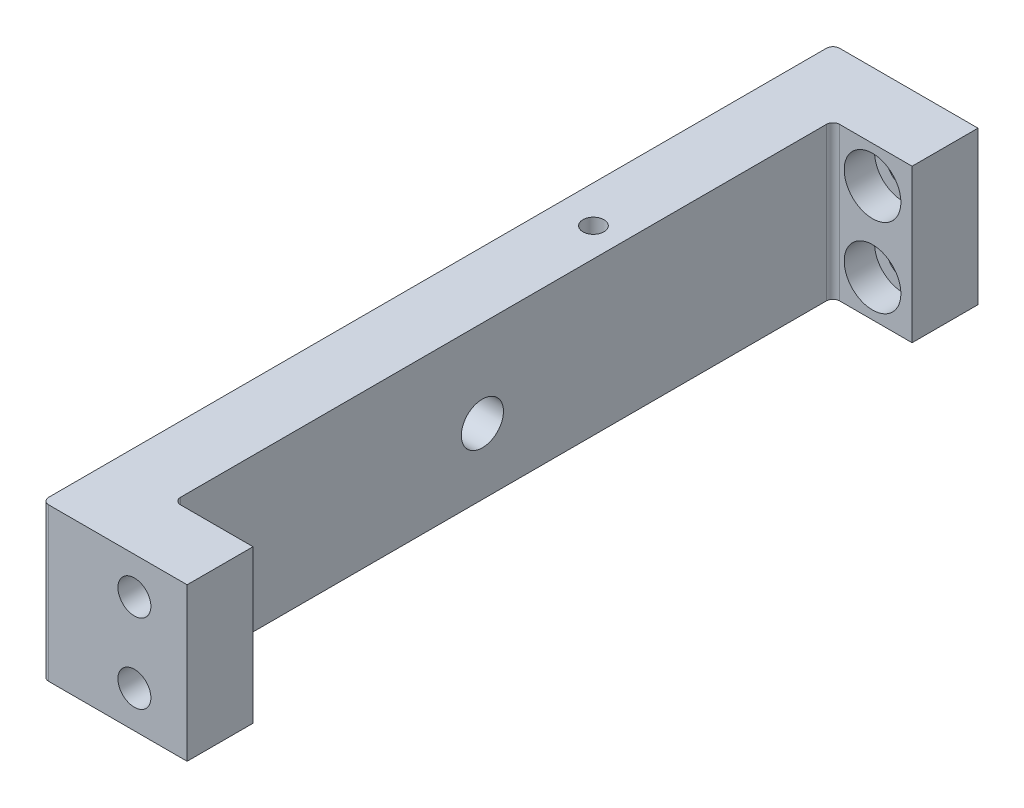
ISO-10303-21;
HEADER;
FILE_DESCRIPTION(('STEP AP214'),'2;1');
FILE_NAME('part.step','',(''),(''),'','','');
FILE_SCHEMA(('AUTOMOTIVE_DESIGN { 1 0 10303 214 1 1 1 1 }'));
ENDSEC;
DATA;
#1=APPLICATION_CONTEXT('core data for automotive mechanical design processes');
#2=APPLICATION_PROTOCOL_DEFINITION('international standard','automotive_design',2000,#1);
#3=PRODUCT_CONTEXT('',#1,'mechanical');
#4=PRODUCT('Part','Part','',(#3));
#5=PRODUCT_RELATED_PRODUCT_CATEGORY('part','',(#4));
#6=PRODUCT_DEFINITION_FORMATION('','',#4);
#7=PRODUCT_DEFINITION_CONTEXT('part definition',#1,'design');
#8=PRODUCT_DEFINITION('design','',#6,#7);
#9=PRODUCT_DEFINITION_SHAPE('','',#8);
#10=(LENGTH_UNIT() NAMED_UNIT(*) SI_UNIT(.MILLI.,.METRE.));
#11=(NAMED_UNIT(*) PLANE_ANGLE_UNIT() SI_UNIT($,.RADIAN.));
#12=(NAMED_UNIT(*) SI_UNIT($,.STERADIAN.) SOLID_ANGLE_UNIT());
#13=UNCERTAINTY_MEASURE_WITH_UNIT(LENGTH_MEASURE(1.E-05),#10,'distance_accuracy_value','');
#14=(GEOMETRIC_REPRESENTATION_CONTEXT(3) GLOBAL_UNCERTAINTY_ASSIGNED_CONTEXT((#13)) GLOBAL_UNIT_ASSIGNED_CONTEXT((#10,
#11,#12)) REPRESENTATION_CONTEXT('',''));
#15=CARTESIAN_POINT('',(0.,0.,0.));
#16=DIRECTION('',(0.,0.,1.));
#17=DIRECTION('',(1.,0.,0.));
#18=AXIS2_PLACEMENT_3D('',#15,#16,#17);
#19=CARTESIAN_POINT('',(2.5,-5.8,30.));
#20=DIRECTION('',(-1.,0.,0.));
#21=DIRECTION('',(0.,0.,1.));
#22=AXIS2_PLACEMENT_3D('',#19,#20,#21);
#23=PLANE('',#22);
#24=CARTESIAN_POINT('',(2.5,-0.799999999999957,1.59999999999999));
#25=DIRECTION('',(-1.,0.,0.));
#26=DIRECTION('',(0.,0.,1.));
#27=AXIS2_PLACEMENT_3D('',#24,#25,#26);
#28=CIRCLE('',#27,1.6);
#29=CARTESIAN_POINT('',(2.5,-0.799999999999957,3.19999999999999));
#30=VERTEX_POINT('',#29);
#31=EDGE_CURVE('E145',#30,#30,#28,.T.);
#32=ORIENTED_EDGE('',*,*,#31,.T.);
#33=EDGE_LOOP('',(#32));
#34=FACE_BOUND('',#33,.T.);
#35=DIRECTION('',(0.,0.,-1.));
#36=VECTOR('',#35,1.);
#37=CARTESIAN_POINT('',(2.5,-5.8,30.));
#38=LINE('',#37,#36);
#39=CARTESIAN_POINT('',(2.5,-5.8,24.5));
#40=VERTEX_POINT('',#39);
#41=CARTESIAN_POINT('',(2.5,-5.8,-24.5));
#42=VERTEX_POINT('',#41);
#43=EDGE_CURVE('E233',#40,#42,#38,.T.);
#44=ORIENTED_EDGE('',*,*,#43,.T.);
#45=DIRECTION('',(0.,1.,0.));
#46=VECTOR('',#45,1.);
#47=CARTESIAN_POINT('',(2.5,-5.80000000000002,-24.5));
#48=LINE('',#47,#46);
#49=CARTESIAN_POINT('',(2.5,5.8,-24.5));
#50=VERTEX_POINT('',#49);
#51=EDGE_CURVE('E260',#42,#50,#48,.T.);
#52=ORIENTED_EDGE('',*,*,#51,.T.);
#53=DIRECTION('',(0.,0.,-1.));
#54=VECTOR('',#53,1.);
#55=CARTESIAN_POINT('',(2.5,5.8,30.));
#56=LINE('',#55,#54);
#57=CARTESIAN_POINT('',(2.5,5.8,24.5));
#58=VERTEX_POINT('',#57);
#59=EDGE_CURVE('E231',#58,#50,#56,.T.);
#60=ORIENTED_EDGE('',*,*,#59,.F.);
#61=DIRECTION('',(0.,1.,0.));
#62=VECTOR('',#61,1.);
#63=CARTESIAN_POINT('',(2.5,-5.8,24.5));
#64=LINE('',#63,#62);
#65=EDGE_CURVE('E258',#58,#40,#64,.F.);
#66=ORIENTED_EDGE('',*,*,#65,.T.);
#67=EDGE_LOOP('',(#44,#52,#60,#66));
#68=FACE_BOUND('',#67,.T.);
#69=ADVANCED_FACE('F42',(#34,#68),#23,.F.);
#70=CARTESIAN_POINT('',(-2.5,-5.8,30.));
#71=DIRECTION('',(1.,0.,0.));
#72=DIRECTION('',(0.,0.,-1.));
#73=AXIS2_PLACEMENT_3D('',#70,#71,#72);
#74=PLANE('',#73);
#75=CARTESIAN_POINT('',(-2.5,-0.799999999999957,1.59999999999999));
#76=DIRECTION('',(-1.,0.,0.));
#77=DIRECTION('',(0.,0.,1.));
#78=AXIS2_PLACEMENT_3D('',#75,#76,#77);
#79=CIRCLE('',#78,1.6);
#80=CARTESIAN_POINT('',(-2.5,-0.799999999999957,3.19999999999999));
#81=VERTEX_POINT('',#80);
#82=EDGE_CURVE('E141',#81,#81,#79,.T.);
#83=ORIENTED_EDGE('',*,*,#82,.F.);
#84=EDGE_LOOP('',(#83));
#85=FACE_BOUND('',#84,.T.);
#86=DIRECTION('',(0.,0.,-1.));
#87=VECTOR('',#86,1.);
#88=CARTESIAN_POINT('',(-2.5,5.8,30.));
#89=LINE('',#88,#87);
#90=CARTESIAN_POINT('',(-2.5,5.8,29.5));
#91=VERTEX_POINT('',#90);
#92=CARTESIAN_POINT('',(-2.5,5.8,-29.5));
#93=VERTEX_POINT('',#92);
#94=EDGE_CURVE('E225',#91,#93,#89,.T.);
#95=ORIENTED_EDGE('',*,*,#94,.T.);
#96=DIRECTION('',(0.,-1.,0.));
#97=VECTOR('',#96,1.);
#98=CARTESIAN_POINT('',(-2.5,-5.8,-29.5));
#99=LINE('',#98,#97);
#100=CARTESIAN_POINT('',(-2.5,-5.8,-29.5));
#101=VERTEX_POINT('',#100);
#102=EDGE_CURVE('E245',#93,#101,#99,.T.);
#103=ORIENTED_EDGE('',*,*,#102,.T.);
#104=DIRECTION('',(0.,0.,-1.));
#105=VECTOR('',#104,1.);
#106=CARTESIAN_POINT('',(-2.5,-5.8,30.));
#107=LINE('',#106,#105);
#108=CARTESIAN_POINT('',(-2.5,-5.8,29.5));
#109=VERTEX_POINT('',#108);
#110=EDGE_CURVE('E236',#109,#101,#107,.T.);
#111=ORIENTED_EDGE('',*,*,#110,.F.);
#112=DIRECTION('',(0.,-1.,0.));
#113=VECTOR('',#112,1.);
#114=CARTESIAN_POINT('',(-2.5,5.8,29.5));
#115=LINE('',#114,#113);
#116=EDGE_CURVE('E239',#109,#91,#115,.F.);
#117=ORIENTED_EDGE('',*,*,#116,.T.);
#118=EDGE_LOOP('',(#95,#103,#111,#117));
#119=FACE_BOUND('',#118,.T.);
#120=ADVANCED_FACE('F302',(#85,#119),#74,.F.);
#121=CARTESIAN_POINT('',(2.5,-5.8,30.));
#122=DIRECTION('',(0.,1.,0.));
#123=DIRECTION('',(0.,0.,1.));
#124=AXIS2_PLACEMENT_3D('',#121,#122,#123);
#125=PLANE('',#124);
#126=ORIENTED_EDGE('',*,*,#110,.T.);
#127=CARTESIAN_POINT('',(-2.,-5.8,-29.5));
#128=DIRECTION('',(0.,1.,0.));
#129=DIRECTION('',(0.,0.,1.));
#130=AXIS2_PLACEMENT_3D('',#127,#128,#129);
#131=CIRCLE('',#130,0.5);
#132=CARTESIAN_POINT('',(-2.,-5.8,-30.));
#133=VERTEX_POINT('',#132);
#134=EDGE_CURVE('E250',#101,#133,#131,.F.);
#135=ORIENTED_EDGE('',*,*,#134,.T.);
#136=DIRECTION('',(1.,0.,0.));
#137=VECTOR('',#136,1.);
#138=CARTESIAN_POINT('',(2.5,-5.8,-30.));
#139=LINE('',#138,#137);
#140=CARTESIAN_POINT('',(8.5,-5.8,-30.));
#141=VERTEX_POINT('',#140);
#142=EDGE_CURVE('E218',#133,#141,#139,.T.);
#143=ORIENTED_EDGE('',*,*,#142,.T.);
#144=DIRECTION('',(0.,0.,1.));
#145=VECTOR('',#144,1.);
#146=CARTESIAN_POINT('',(8.5,-5.8,-25.));
#147=LINE('',#146,#145);
#148=CARTESIAN_POINT('',(8.5,-5.8,-25.));
#149=VERTEX_POINT('',#148);
#150=EDGE_CURVE('E184',#141,#149,#147,.T.);
#151=ORIENTED_EDGE('',*,*,#150,.T.);
#152=DIRECTION('',(-1.,0.,0.));
#153=VECTOR('',#152,1.);
#154=CARTESIAN_POINT('',(8.5,-5.8,-25.));
#155=LINE('',#154,#153);
#156=CARTESIAN_POINT('',(3.,-5.8,-25.));
#157=VERTEX_POINT('',#156);
#158=EDGE_CURVE('E196',#149,#157,#155,.T.);
#159=ORIENTED_EDGE('',*,*,#158,.T.);
#160=CARTESIAN_POINT('',(3.,-5.8,-24.5));
#161=DIRECTION('',(0.,1.,0.));
#162=DIRECTION('',(0.,0.,1.));
#163=AXIS2_PLACEMENT_3D('',#160,#161,#162);
#164=CIRCLE('',#163,0.5);
#165=EDGE_CURVE('E271',#157,#42,#164,.T.);
#166=ORIENTED_EDGE('',*,*,#165,.T.);
#167=ORIENTED_EDGE('',*,*,#43,.F.);
#168=CARTESIAN_POINT('',(3.,-5.8,24.5));
#169=DIRECTION('',(0.,1.,0.));
#170=DIRECTION('',(0.,0.,1.));
#171=AXIS2_PLACEMENT_3D('',#168,#169,#170);
#172=CIRCLE('',#171,0.5);
#173=CARTESIAN_POINT('',(3.,-5.8,25.));
#174=VERTEX_POINT('',#173);
#175=EDGE_CURVE('E11',#40,#174,#172,.T.);
#176=ORIENTED_EDGE('',*,*,#175,.T.);
#177=DIRECTION('',(-1.,0.,0.));
#178=VECTOR('',#177,1.);
#179=CARTESIAN_POINT('',(8.5,-5.8,25.));
#180=LINE('',#179,#178);
#181=CARTESIAN_POINT('',(8.5,-5.8,25.));
#182=VERTEX_POINT('',#181);
#183=EDGE_CURVE('E215',#182,#174,#180,.T.);
#184=ORIENTED_EDGE('',*,*,#183,.F.);
#185=DIRECTION('',(0.,0.,-1.));
#186=VECTOR('',#185,1.);
#187=CARTESIAN_POINT('',(8.5,-5.8,25.));
#188=LINE('',#187,#186);
#189=CARTESIAN_POINT('',(8.5,-5.8,30.));
#190=VERTEX_POINT('',#189);
#191=EDGE_CURVE('E201',#190,#182,#188,.T.);
#192=ORIENTED_EDGE('',*,*,#191,.F.);
#193=DIRECTION('',(1.,0.,0.));
#194=VECTOR('',#193,1.);
#195=CARTESIAN_POINT('',(2.5,-5.8,30.));
#196=LINE('',#195,#194);
#197=CARTESIAN_POINT('',(-2.,-5.8,30.));
#198=VERTEX_POINT('',#197);
#199=EDGE_CURVE('E219',#198,#190,#196,.T.);
#200=ORIENTED_EDGE('',*,*,#199,.F.);
#201=CARTESIAN_POINT('',(-2.,-5.8,29.5));
#202=DIRECTION('',(0.,1.,0.));
#203=DIRECTION('',(0.,0.,1.));
#204=AXIS2_PLACEMENT_3D('',#201,#202,#203);
#205=CIRCLE('',#204,0.5);
#206=EDGE_CURVE('E248',#198,#109,#205,.F.);
#207=ORIENTED_EDGE('',*,*,#206,.T.);
#208=EDGE_LOOP('',(#126,#135,#143,#151,#159,#166,#167,#176,#184,#192,#200,#207));
#209=FACE_BOUND('',#208,.T.);
#210=ADVANCED_FACE('F285',(#209),#125,.F.);
#211=CARTESIAN_POINT('',(2.5,5.8,30.));
#212=DIRECTION('',(0.,-1.,0.));
#213=DIRECTION('',(0.,0.,-1.));
#214=AXIS2_PLACEMENT_3D('',#211,#212,#213);
#215=PLANE('',#214);
#216=CARTESIAN_POINT('',(0.324999999999982,5.8,-8.99999999999998));
#217=DIRECTION('',(0.,1.,0.));
#218=DIRECTION('',(0.,0.,1.));
#219=AXIS2_PLACEMENT_3D('',#216,#217,#218);
#220=CIRCLE('',#219,0.79999999999999);
#221=CARTESIAN_POINT('',(0.324999999999982,5.8,-8.19999999999999));
#222=VERTEX_POINT('',#221);
#223=EDGE_CURVE('E142',#222,#222,#220,.T.);
#224=ORIENTED_EDGE('',*,*,#223,.F.);
#225=EDGE_LOOP('',(#224));
#226=FACE_BOUND('',#225,.T.);
#227=DIRECTION('',(-1.,0.,0.));
#228=VECTOR('',#227,1.);
#229=CARTESIAN_POINT('',(2.5,5.8,-30.));
#230=LINE('',#229,#228);
#231=CARTESIAN_POINT('',(8.5,5.8,-30.));
#232=VERTEX_POINT('',#231);
#233=CARTESIAN_POINT('',(-2.,5.8,-30.));
#234=VERTEX_POINT('',#233);
#235=EDGE_CURVE('E222',#232,#234,#230,.T.);
#236=ORIENTED_EDGE('',*,*,#235,.T.);
#237=CARTESIAN_POINT('',(-2.,5.8,-29.5));
#238=DIRECTION('',(0.,-1.,0.));
#239=DIRECTION('',(0.,0.,-1.));
#240=AXIS2_PLACEMENT_3D('',#237,#238,#239);
#241=CIRCLE('',#240,0.5);
#242=EDGE_CURVE('E256',#234,#93,#241,.F.);
#243=ORIENTED_EDGE('',*,*,#242,.T.);
#244=ORIENTED_EDGE('',*,*,#94,.F.);
#245=CARTESIAN_POINT('',(-2.,5.8,29.5));
#246=DIRECTION('',(0.,-1.,0.));
#247=DIRECTION('',(0.,0.,-1.));
#248=AXIS2_PLACEMENT_3D('',#245,#246,#247);
#249=CIRCLE('',#248,0.5);
#250=CARTESIAN_POINT('',(-2.,5.8,30.));
#251=VERTEX_POINT('',#250);
#252=EDGE_CURVE('E254',#91,#251,#249,.F.);
#253=ORIENTED_EDGE('',*,*,#252,.T.);
#254=DIRECTION('',(-1.,0.,0.));
#255=VECTOR('',#254,1.);
#256=CARTESIAN_POINT('',(2.5,5.8,30.));
#257=LINE('',#256,#255);
#258=CARTESIAN_POINT('',(8.5,5.8,30.));
#259=VERTEX_POINT('',#258);
#260=EDGE_CURVE('E221',#259,#251,#257,.T.);
#261=ORIENTED_EDGE('',*,*,#260,.F.);
#262=DIRECTION('',(0.,0.,1.));
#263=VECTOR('',#262,1.);
#264=CARTESIAN_POINT('',(8.5,5.8,30.));
#265=LINE('',#264,#263);
#266=CARTESIAN_POINT('',(8.5,5.8,25.));
#267=VERTEX_POINT('',#266);
#268=EDGE_CURVE('E206',#267,#259,#265,.T.);
#269=ORIENTED_EDGE('',*,*,#268,.F.);
#270=DIRECTION('',(-1.,0.,0.));
#271=VECTOR('',#270,1.);
#272=CARTESIAN_POINT('',(8.5,5.8,25.));
#273=LINE('',#272,#271);
#274=CARTESIAN_POINT('',(3.,5.8,25.));
#275=VERTEX_POINT('',#274);
#276=EDGE_CURVE('E212',#267,#275,#273,.T.);
#277=ORIENTED_EDGE('',*,*,#276,.T.);
#278=CARTESIAN_POINT('',(3.,5.8,24.5));
#279=DIRECTION('',(0.,-1.,0.));
#280=DIRECTION('',(0.,0.,-1.));
#281=AXIS2_PLACEMENT_3D('',#278,#279,#280);
#282=CIRCLE('',#281,0.5);
#283=EDGE_CURVE('E50',#275,#58,#282,.T.);
#284=ORIENTED_EDGE('',*,*,#283,.T.);
#285=ORIENTED_EDGE('',*,*,#59,.T.);
#286=CARTESIAN_POINT('',(3.,5.8,-24.5));
#287=DIRECTION('',(0.,-1.,0.));
#288=DIRECTION('',(0.,0.,-1.));
#289=AXIS2_PLACEMENT_3D('',#286,#287,#288);
#290=CIRCLE('',#289,0.5);
#291=CARTESIAN_POINT('',(3.,5.8,-25.));
#292=VERTEX_POINT('',#291);
#293=EDGE_CURVE('E57',#50,#292,#290,.T.);
#294=ORIENTED_EDGE('',*,*,#293,.T.);
#295=DIRECTION('',(-1.,0.,0.));
#296=VECTOR('',#295,1.);
#297=CARTESIAN_POINT('',(8.5,5.8,-25.));
#298=LINE('',#297,#296);
#299=CARTESIAN_POINT('',(8.5,5.8,-25.));
#300=VERTEX_POINT('',#299);
#301=EDGE_CURVE('E199',#300,#292,#298,.T.);
#302=ORIENTED_EDGE('',*,*,#301,.F.);
#303=DIRECTION('',(0.,0.,-1.));
#304=VECTOR('',#303,1.);
#305=CARTESIAN_POINT('',(8.5,5.8,-30.));
#306=LINE('',#305,#304);
#307=EDGE_CURVE('E190',#300,#232,#306,.T.);
#308=ORIENTED_EDGE('',*,*,#307,.T.);
#309=EDGE_LOOP('',(#236,#243,#244,#253,#261,#269,#277,#284,#285,#294,#302,#308));
#310=FACE_BOUND('',#309,.T.);
#311=ADVANCED_FACE('F273',(#226,#310),#215,.F.);
#312=CARTESIAN_POINT('',(0.,0.,30.));
#313=DIRECTION('',(0.,0.,1.));
#314=DIRECTION('',(1.,0.,0.));
#315=AXIS2_PLACEMENT_3D('',#312,#313,#314);
#316=PLANE('',#315);
#317=CARTESIAN_POINT('',(4.5,-3.,30.));
#318=DIRECTION('',(0.,0.,1.));
#319=DIRECTION('',(1.,0.,0.));
#320=AXIS2_PLACEMENT_3D('',#317,#318,#319);
#321=CIRCLE('',#320,1.24999999999999);
#322=CARTESIAN_POINT('',(5.74999999999999,-3.,30.));
#323=VERTEX_POINT('',#322);
#324=EDGE_CURVE('E172',#323,#323,#321,.T.);
#325=ORIENTED_EDGE('',*,*,#324,.F.);
#326=EDGE_LOOP('',(#325));
#327=FACE_BOUND('',#326,.T.);
#328=CARTESIAN_POINT('',(4.5,3.,30.));
#329=DIRECTION('',(0.,0.,1.));
#330=DIRECTION('',(1.,0.,0.));
#331=AXIS2_PLACEMENT_3D('',#328,#329,#330);
#332=CIRCLE('',#331,1.24999999999999);
#333=CARTESIAN_POINT('',(5.74999999999999,3.,30.));
#334=VERTEX_POINT('',#333);
#335=EDGE_CURVE('E178',#334,#334,#332,.T.);
#336=ORIENTED_EDGE('',*,*,#335,.F.);
#337=EDGE_LOOP('',(#336));
#338=FACE_BOUND('',#337,.T.);
#339=ORIENTED_EDGE('',*,*,#260,.T.);
#340=DIRECTION('',(0.,-1.,0.));
#341=VECTOR('',#340,1.);
#342=CARTESIAN_POINT('',(-2.,-5.8,30.));
#343=LINE('',#342,#341);
#344=EDGE_CURVE('E267',#251,#198,#343,.T.);
#345=ORIENTED_EDGE('',*,*,#344,.T.);
#346=ORIENTED_EDGE('',*,*,#199,.T.);
#347=DIRECTION('',(0.,-1.,0.));
#348=VECTOR('',#347,1.);
#349=CARTESIAN_POINT('',(8.5,-5.8,30.));
#350=LINE('',#349,#348);
#351=EDGE_CURVE('E209',#259,#190,#350,.T.);
#352=ORIENTED_EDGE('',*,*,#351,.F.);
#353=EDGE_LOOP('',(#339,#345,#346,#352));
#354=FACE_BOUND('',#353,.T.);
#355=ADVANCED_FACE('F295',(#327,#338,#354),#316,.T.);
#356=CARTESIAN_POINT('',(0.,0.,-30.));
#357=DIRECTION('',(0.,0.,1.));
#358=DIRECTION('',(1.,0.,0.));
#359=AXIS2_PLACEMENT_3D('',#356,#357,#358);
#360=PLANE('',#359);
#361=CARTESIAN_POINT('',(5.5,-3.00000000000001,-30.));
#362=DIRECTION('',(0.,0.,1.));
#363=DIRECTION('',(1.,0.,0.));
#364=AXIS2_PLACEMENT_3D('',#361,#362,#363);
#365=CIRCLE('',#364,1.2);
#366=CARTESIAN_POINT('',(6.7,-3.00000000000001,-30.));
#367=VERTEX_POINT('',#366);
#368=EDGE_CURVE('E161',#367,#367,#365,.T.);
#369=ORIENTED_EDGE('',*,*,#368,.T.);
#370=EDGE_LOOP('',(#369));
#371=FACE_BOUND('',#370,.T.);
#372=CARTESIAN_POINT('',(5.5,2.99999999999999,-30.));
#373=DIRECTION('',(0.,0.,1.));
#374=DIRECTION('',(1.,0.,0.));
#375=AXIS2_PLACEMENT_3D('',#372,#373,#374);
#376=CIRCLE('',#375,1.2);
#377=CARTESIAN_POINT('',(6.7,2.99999999999999,-30.));
#378=VERTEX_POINT('',#377);
#379=EDGE_CURVE('E171',#378,#378,#376,.T.);
#380=ORIENTED_EDGE('',*,*,#379,.T.);
#381=EDGE_LOOP('',(#380));
#382=FACE_BOUND('',#381,.T.);
#383=ORIENTED_EDGE('',*,*,#142,.F.);
#384=DIRECTION('',(0.,-1.,0.));
#385=VECTOR('',#384,1.);
#386=CARTESIAN_POINT('',(-2.,0.,-30.));
#387=LINE('',#386,#385);
#388=EDGE_CURVE('E252',#133,#234,#387,.F.);
#389=ORIENTED_EDGE('',*,*,#388,.T.);
#390=ORIENTED_EDGE('',*,*,#235,.F.);
#391=DIRECTION('',(0.,-1.,0.));
#392=VECTOR('',#391,1.);
#393=CARTESIAN_POINT('',(8.5,-5.8,-30.));
#394=LINE('',#393,#392);
#395=EDGE_CURVE('E187',#232,#141,#394,.T.);
#396=ORIENTED_EDGE('',*,*,#395,.T.);
#397=EDGE_LOOP('',(#383,#389,#390,#396));
#398=FACE_BOUND('',#397,.T.);
#399=ADVANCED_FACE('F311',(#371,#382,#398),#360,.F.);
#400=CARTESIAN_POINT('',(8.5,5.8,25.));
#401=DIRECTION('',(0.,0.,1.));
#402=DIRECTION('',(0.,-1.,0.));
#403=AXIS2_PLACEMENT_3D('',#400,#401,#402);
#404=PLANE('',#403);
#405=CARTESIAN_POINT('',(4.5,-3.,25.));
#406=DIRECTION('',(0.,0.,1.));
#407=DIRECTION('',(0.,-1.,0.));
#408=AXIS2_PLACEMENT_3D('',#405,#406,#407);
#409=CIRCLE('',#408,1.24999999999999);
#410=CARTESIAN_POINT('',(4.5,-4.24999999999999,25.));
#411=VERTEX_POINT('',#410);
#412=EDGE_CURVE('E175',#411,#411,#409,.T.);
#413=ORIENTED_EDGE('',*,*,#412,.T.);
#414=EDGE_LOOP('',(#413));
#415=FACE_BOUND('',#414,.T.);
#416=CARTESIAN_POINT('',(4.5,3.,25.));
#417=DIRECTION('',(0.,0.,1.));
#418=DIRECTION('',(0.,-1.,0.));
#419=AXIS2_PLACEMENT_3D('',#416,#417,#418);
#420=CIRCLE('',#419,1.24999999999999);
#421=CARTESIAN_POINT('',(4.5,1.75000000000001,25.));
#422=VERTEX_POINT('',#421);
#423=EDGE_CURVE('E181',#422,#422,#420,.T.);
#424=ORIENTED_EDGE('',*,*,#423,.T.);
#425=EDGE_LOOP('',(#424));
#426=FACE_BOUND('',#425,.T.);
#427=ORIENTED_EDGE('',*,*,#183,.T.);
#428=DIRECTION('',(0.,1.,0.));
#429=VECTOR('',#428,1.);
#430=CARTESIAN_POINT('',(3.,5.8,25.));
#431=LINE('',#430,#429);
#432=EDGE_CURVE('E264',#174,#275,#431,.T.);
#433=ORIENTED_EDGE('',*,*,#432,.T.);
#434=ORIENTED_EDGE('',*,*,#276,.F.);
#435=DIRECTION('',(0.,1.,0.));
#436=VECTOR('',#435,1.);
#437=CARTESIAN_POINT('',(8.5,5.8,25.));
#438=LINE('',#437,#436);
#439=EDGE_CURVE('E204',#182,#267,#438,.T.);
#440=ORIENTED_EDGE('',*,*,#439,.F.);
#441=EDGE_LOOP('',(#427,#433,#434,#440));
#442=FACE_BOUND('',#441,.T.);
#443=ADVANCED_FACE('F288',(#415,#426,#442),#404,.F.);
#444=CARTESIAN_POINT('',(8.5,0.,0.));
#445=DIRECTION('',(-1.,0.,0.));
#446=DIRECTION('',(0.,0.,1.));
#447=AXIS2_PLACEMENT_3D('',#444,#445,#446);
#448=PLANE('',#447);
#449=ORIENTED_EDGE('',*,*,#191,.T.);
#450=ORIENTED_EDGE('',*,*,#439,.T.);
#451=ORIENTED_EDGE('',*,*,#268,.T.);
#452=ORIENTED_EDGE('',*,*,#351,.T.);
#453=EDGE_LOOP('',(#449,#450,#451,#452));
#454=FACE_BOUND('',#453,.T.);
#455=ADVANCED_FACE('F290',(#454),#448,.F.);
#456=CARTESIAN_POINT('',(8.5,5.8,-25.));
#457=DIRECTION('',(0.,0.,1.));
#458=DIRECTION('',(0.,-1.,0.));
#459=AXIS2_PLACEMENT_3D('',#456,#457,#458);
#460=PLANE('',#459);
#461=CARTESIAN_POINT('',(5.5,-3.00000000000001,-25.));
#462=DIRECTION('',(0.,0.,1.));
#463=DIRECTION('',(1.,0.,0.));
#464=AXIS2_PLACEMENT_3D('',#461,#462,#463);
#465=CIRCLE('',#464,2.15);
#466=CARTESIAN_POINT('',(7.65,-3.00000000000001,-25.));
#467=VERTEX_POINT('',#466);
#468=EDGE_CURVE('E152',#467,#467,#465,.T.);
#469=ORIENTED_EDGE('',*,*,#468,.F.);
#470=EDGE_LOOP('',(#469));
#471=FACE_BOUND('',#470,.T.);
#472=CARTESIAN_POINT('',(5.5,2.99999999999999,-25.));
#473=DIRECTION('',(0.,0.,1.));
#474=DIRECTION('',(1.,0.,0.));
#475=AXIS2_PLACEMENT_3D('',#472,#473,#474);
#476=CIRCLE('',#475,2.15);
#477=CARTESIAN_POINT('',(7.65,2.99999999999999,-25.));
#478=VERTEX_POINT('',#477);
#479=EDGE_CURVE('E162',#478,#478,#476,.T.);
#480=ORIENTED_EDGE('',*,*,#479,.F.);
#481=EDGE_LOOP('',(#480));
#482=FACE_BOUND('',#481,.T.);
#483=ORIENTED_EDGE('',*,*,#301,.T.);
#484=DIRECTION('',(0.,1.,0.));
#485=VECTOR('',#484,1.);
#486=CARTESIAN_POINT('',(3.,5.8,-25.));
#487=LINE('',#486,#485);
#488=EDGE_CURVE('E262',#292,#157,#487,.F.);
#489=ORIENTED_EDGE('',*,*,#488,.T.);
#490=ORIENTED_EDGE('',*,*,#158,.F.);
#491=DIRECTION('',(0.,1.,0.));
#492=VECTOR('',#491,1.);
#493=CARTESIAN_POINT('',(8.5,5.8,-25.));
#494=LINE('',#493,#492);
#495=EDGE_CURVE('E193',#149,#300,#494,.T.);
#496=ORIENTED_EDGE('',*,*,#495,.T.);
#497=EDGE_LOOP('',(#483,#489,#490,#496));
#498=FACE_BOUND('',#497,.T.);
#499=ADVANCED_FACE('F318',(#471,#482,#498),#460,.T.);
#500=CARTESIAN_POINT('',(8.5,0.,0.));
#501=DIRECTION('',(-1.,0.,0.));
#502=DIRECTION('',(0.,0.,-1.));
#503=AXIS2_PLACEMENT_3D('',#500,#501,#502);
#504=PLANE('',#503);
#505=ORIENTED_EDGE('',*,*,#150,.F.);
#506=ORIENTED_EDGE('',*,*,#395,.F.);
#507=ORIENTED_EDGE('',*,*,#307,.F.);
#508=ORIENTED_EDGE('',*,*,#495,.F.);
#509=EDGE_LOOP('',(#505,#506,#507,#508));
#510=FACE_BOUND('',#509,.T.);
#511=ADVANCED_FACE('F315',(#510),#504,.F.);
#512=CARTESIAN_POINT('',(4.5,3.,30.));
#513=DIRECTION('',(0.,0.,1.));
#514=DIRECTION('',(1.,0.,0.));
#515=AXIS2_PLACEMENT_3D('',#512,#513,#514);
#516=CYLINDRICAL_SURFACE('',#515,1.24999999999999);
#517=ORIENTED_EDGE('',*,*,#335,.T.);
#518=EDGE_LOOP('',(#517));
#519=FACE_BOUND('',#518,.T.);
#520=ORIENTED_EDGE('',*,*,#423,.F.);
#521=EDGE_LOOP('',(#520));
#522=FACE_BOUND('',#521,.T.);
#523=ADVANCED_FACE('F386',(#519,#522),#516,.F.);
#524=CARTESIAN_POINT('',(4.5,-3.,30.));
#525=DIRECTION('',(0.,0.,1.));
#526=DIRECTION('',(1.,0.,0.));
#527=AXIS2_PLACEMENT_3D('',#524,#525,#526);
#528=CYLINDRICAL_SURFACE('',#527,1.24999999999999);
#529=ORIENTED_EDGE('',*,*,#324,.T.);
#530=EDGE_LOOP('',(#529));
#531=FACE_BOUND('',#530,.T.);
#532=ORIENTED_EDGE('',*,*,#412,.F.);
#533=EDGE_LOOP('',(#532));
#534=FACE_BOUND('',#533,.T.);
#535=ADVANCED_FACE('F382',(#531,#534),#528,.F.);
#536=CARTESIAN_POINT('',(5.5,2.99999999999999,-25.));
#537=DIRECTION('',(0.,0.,1.));
#538=DIRECTION('',(1.,0.,0.));
#539=AXIS2_PLACEMENT_3D('',#536,#537,#538);
#540=CYLINDRICAL_SURFACE('',#539,1.2);
#541=CARTESIAN_POINT('',(5.5,2.99999999999999,-27.3));
#542=DIRECTION('',(0.,0.,1.));
#543=DIRECTION('',(1.,0.,0.));
#544=AXIS2_PLACEMENT_3D('',#541,#542,#543);
#545=CIRCLE('',#544,1.2);
#546=CARTESIAN_POINT('',(6.7,2.99999999999999,-27.3));
#547=VERTEX_POINT('',#546);
#548=EDGE_CURVE('E168',#547,#547,#545,.T.);
#549=ORIENTED_EDGE('',*,*,#548,.T.);
#550=EDGE_LOOP('',(#549));
#551=FACE_BOUND('',#550,.T.);
#552=ORIENTED_EDGE('',*,*,#379,.F.);
#553=EDGE_LOOP('',(#552));
#554=FACE_BOUND('',#553,.T.);
#555=ADVANCED_FACE('F378',(#551,#554),#540,.F.);
#556=CARTESIAN_POINT('',(6.7,2.99999999999999,-27.3));
#557=DIRECTION('',(0.,0.,-1.));
#558=DIRECTION('',(-1.,0.,0.));
#559=AXIS2_PLACEMENT_3D('',#556,#557,#558);
#560=PLANE('',#559);
#561=ORIENTED_EDGE('',*,*,#548,.F.);
#562=EDGE_LOOP('',(#561));
#563=FACE_BOUND('',#562,.T.);
#564=CARTESIAN_POINT('',(5.5,2.99999999999999,-27.3));
#565=DIRECTION('',(0.,0.,1.));
#566=DIRECTION('',(1.,0.,0.));
#567=AXIS2_PLACEMENT_3D('',#564,#565,#566);
#568=CIRCLE('',#567,2.15);
#569=CARTESIAN_POINT('',(7.65,2.99999999999999,-27.3));
#570=VERTEX_POINT('',#569);
#571=EDGE_CURVE('E165',#570,#570,#568,.T.);
#572=ORIENTED_EDGE('',*,*,#571,.T.);
#573=EDGE_LOOP('',(#572));
#574=FACE_BOUND('',#573,.T.);
#575=ADVANCED_FACE('F374',(#563,#574),#560,.F.);
#576=CARTESIAN_POINT('',(5.5,2.99999999999999,-25.));
#577=DIRECTION('',(0.,0.,1.));
#578=DIRECTION('',(1.,0.,0.));
#579=AXIS2_PLACEMENT_3D('',#576,#577,#578);
#580=CYLINDRICAL_SURFACE('',#579,2.15);
#581=ORIENTED_EDGE('',*,*,#571,.F.);
#582=EDGE_LOOP('',(#581));
#583=FACE_BOUND('',#582,.T.);
#584=ORIENTED_EDGE('',*,*,#479,.T.);
#585=EDGE_LOOP('',(#584));
#586=FACE_BOUND('',#585,.T.);
#587=ADVANCED_FACE('F370',(#583,#586),#580,.F.);
#588=CARTESIAN_POINT('',(5.5,-3.00000000000001,-25.));
#589=DIRECTION('',(0.,0.,1.));
#590=DIRECTION('',(1.,0.,0.));
#591=AXIS2_PLACEMENT_3D('',#588,#589,#590);
#592=CYLINDRICAL_SURFACE('',#591,1.2);
#593=CARTESIAN_POINT('',(5.5,-3.00000000000001,-27.3));
#594=DIRECTION('',(0.,0.,1.));
#595=DIRECTION('',(1.,0.,0.));
#596=AXIS2_PLACEMENT_3D('',#593,#594,#595);
#597=CIRCLE('',#596,1.2);
#598=CARTESIAN_POINT('',(6.7,-3.00000000000001,-27.3));
#599=VERTEX_POINT('',#598);
#600=EDGE_CURVE('E158',#599,#599,#597,.T.);
#601=ORIENTED_EDGE('',*,*,#600,.T.);
#602=EDGE_LOOP('',(#601));
#603=FACE_BOUND('',#602,.T.);
#604=ORIENTED_EDGE('',*,*,#368,.F.);
#605=EDGE_LOOP('',(#604));
#606=FACE_BOUND('',#605,.T.);
#607=ADVANCED_FACE('F366',(#603,#606),#592,.F.);
#608=CARTESIAN_POINT('',(6.7,-3.00000000000001,-27.3));
#609=DIRECTION('',(0.,0.,-1.));
#610=DIRECTION('',(-1.,0.,0.));
#611=AXIS2_PLACEMENT_3D('',#608,#609,#610);
#612=PLANE('',#611);
#613=ORIENTED_EDGE('',*,*,#600,.F.);
#614=EDGE_LOOP('',(#613));
#615=FACE_BOUND('',#614,.T.);
#616=CARTESIAN_POINT('',(5.5,-3.00000000000001,-27.3));
#617=DIRECTION('',(0.,0.,1.));
#618=DIRECTION('',(1.,0.,0.));
#619=AXIS2_PLACEMENT_3D('',#616,#617,#618);
#620=CIRCLE('',#619,2.15);
#621=CARTESIAN_POINT('',(7.65,-3.00000000000001,-27.3));
#622=VERTEX_POINT('',#621);
#623=EDGE_CURVE('E155',#622,#622,#620,.T.);
#624=ORIENTED_EDGE('',*,*,#623,.T.);
#625=EDGE_LOOP('',(#624));
#626=FACE_BOUND('',#625,.T.);
#627=ADVANCED_FACE('F362',(#615,#626),#612,.F.);
#628=CARTESIAN_POINT('',(5.5,-3.00000000000001,-25.));
#629=DIRECTION('',(0.,0.,1.));
#630=DIRECTION('',(1.,0.,0.));
#631=AXIS2_PLACEMENT_3D('',#628,#629,#630);
#632=CYLINDRICAL_SURFACE('',#631,2.15);
#633=ORIENTED_EDGE('',*,*,#623,.F.);
#634=EDGE_LOOP('',(#633));
#635=FACE_BOUND('',#634,.T.);
#636=ORIENTED_EDGE('',*,*,#468,.T.);
#637=EDGE_LOOP('',(#636));
#638=FACE_BOUND('',#637,.T.);
#639=ADVANCED_FACE('F327',(#635,#638),#632,.F.);
#640=CARTESIAN_POINT('',(-2.,-5.8,-29.5));
#641=DIRECTION('',(0.,-1.,0.));
#642=DIRECTION('',(0.,0.,-1.));
#643=AXIS2_PLACEMENT_3D('',#640,#641,#642);
#644=CYLINDRICAL_SURFACE('',#643,0.5);
#645=ORIENTED_EDGE('',*,*,#242,.F.);
#646=ORIENTED_EDGE('',*,*,#388,.F.);
#647=ORIENTED_EDGE('',*,*,#134,.F.);
#648=ORIENTED_EDGE('',*,*,#102,.F.);
#649=EDGE_LOOP('',(#645,#646,#647,#648));
#650=FACE_BOUND('',#649,.T.);
#651=ADVANCED_FACE('F307',(#650),#644,.T.);
#652=CARTESIAN_POINT('',(3.,-5.80000000000002,-24.5));
#653=DIRECTION('',(0.,1.,0.));
#654=DIRECTION('',(0.,0.,1.));
#655=AXIS2_PLACEMENT_3D('',#652,#653,#654);
#656=CYLINDRICAL_SURFACE('',#655,0.5);
#657=ORIENTED_EDGE('',*,*,#165,.F.);
#658=ORIENTED_EDGE('',*,*,#488,.F.);
#659=ORIENTED_EDGE('',*,*,#293,.F.);
#660=ORIENTED_EDGE('',*,*,#51,.F.);
#661=EDGE_LOOP('',(#657,#658,#659,#660));
#662=FACE_BOUND('',#661,.T.);
#663=ADVANCED_FACE('F320',(#662),#656,.F.);
#664=CARTESIAN_POINT('',(3.,5.8,24.5));
#665=DIRECTION('',(0.,-1.,0.));
#666=DIRECTION('',(0.,0.,-1.));
#667=AXIS2_PLACEMENT_3D('',#664,#665,#666);
#668=CYLINDRICAL_SURFACE('',#667,0.5);
#669=ORIENTED_EDGE('',*,*,#175,.F.);
#670=ORIENTED_EDGE('',*,*,#65,.F.);
#671=ORIENTED_EDGE('',*,*,#283,.F.);
#672=ORIENTED_EDGE('',*,*,#432,.F.);
#673=EDGE_LOOP('',(#669,#670,#671,#672));
#674=FACE_BOUND('',#673,.T.);
#675=ADVANCED_FACE('F282',(#674),#668,.F.);
#676=CARTESIAN_POINT('',(-2.,0.,29.5));
#677=DIRECTION('',(0.,1.,0.));
#678=DIRECTION('',(0.,0.,1.));
#679=AXIS2_PLACEMENT_3D('',#676,#677,#678);
#680=CYLINDRICAL_SURFACE('',#679,0.5);
#681=ORIENTED_EDGE('',*,*,#252,.F.);
#682=ORIENTED_EDGE('',*,*,#116,.F.);
#683=ORIENTED_EDGE('',*,*,#206,.F.);
#684=ORIENTED_EDGE('',*,*,#344,.F.);
#685=EDGE_LOOP('',(#681,#682,#683,#684));
#686=FACE_BOUND('',#685,.T.);
#687=ADVANCED_FACE('F44',(#686),#680,.T.);
#688=CARTESIAN_POINT('',(-2.5,-0.799999999999957,1.59999999999999));
#689=DIRECTION('',(-1.,0.,0.));
#690=DIRECTION('',(0.,0.,1.));
#691=AXIS2_PLACEMENT_3D('',#688,#689,#690);
#692=CYLINDRICAL_SURFACE('',#691,1.6);
#693=ORIENTED_EDGE('',*,*,#82,.T.);
#694=EDGE_LOOP('',(#693));
#695=FACE_BOUND('',#694,.T.);
#696=ORIENTED_EDGE('',*,*,#31,.F.);
#697=EDGE_LOOP('',(#696));
#698=FACE_BOUND('',#697,.T.);
#699=ADVANCED_FACE('F135',(#695,#698),#692,.F.);
#700=CARTESIAN_POINT('',(0.324999999999982,0.600000000000003,-8.99999999999998));
#701=DIRECTION('',(0.,1.,0.));
#702=DIRECTION('',(0.,0.,1.));
#703=AXIS2_PLACEMENT_3D('',#700,#701,#702);
#704=CONICAL_SURFACE('',#703,0.799999999999988,1.02974425867664);
#705=CARTESIAN_POINT('',(0.32499999999998,0.11931150477795,-8.99999999999998));
#706=VERTEX_POINT('',#705);
#707=VERTEX_LOOP('',#706);
#708=FACE_BOUND('',#707,.T.);
#709=CARTESIAN_POINT('',(0.324999999999982,0.600000000000003,-8.99999999999998));
#710=DIRECTION('',(0.,1.,0.));
#711=DIRECTION('',(0.,0.,1.));
#712=AXIS2_PLACEMENT_3D('',#709,#710,#711);
#713=CIRCLE('',#712,0.799999999999988);
#714=CARTESIAN_POINT('',(0.324999999999982,0.600000000000003,-8.19999999999999));
#715=VERTEX_POINT('',#714);
#716=EDGE_CURVE('E139',#715,#715,#713,.T.);
#717=ORIENTED_EDGE('',*,*,#716,.T.);
#718=EDGE_LOOP('',(#717));
#719=FACE_BOUND('',#718,.T.);
#720=ADVANCED_FACE('F131',(#708,#719),#704,.F.);
#721=CARTESIAN_POINT('',(0.324999999999982,5.8,-8.99999999999998));
#722=DIRECTION('',(0.,1.,0.));
#723=DIRECTION('',(0.,0.,1.));
#724=AXIS2_PLACEMENT_3D('',#721,#722,#723);
#725=CYLINDRICAL_SURFACE('',#724,0.799999999999989);
#726=ORIENTED_EDGE('',*,*,#716,.F.);
#727=EDGE_LOOP('',(#726));
#728=FACE_BOUND('',#727,.T.);
#729=ORIENTED_EDGE('',*,*,#223,.T.);
#730=EDGE_LOOP('',(#729));
#731=FACE_BOUND('',#730,.T.);
#732=ADVANCED_FACE('F134',(#728,#731),#725,.F.);
#733=CLOSED_SHELL('',(#69,#120,#210,#311,#355,#399,#443,#455,#499,#511,#523,#535,#555,#575,#587,
#607,#627,#639,#651,#663,#675,#687,#699,#720,#732));
#734=MANIFOLD_SOLID_BREP('B2',#733);
#735=ADVANCED_BREP_SHAPE_REPRESENTATION('',(#18,#734),#14);
#736=SHAPE_DEFINITION_REPRESENTATION(#9,#735);
ENDSEC;
END-ISO-10303-21;
